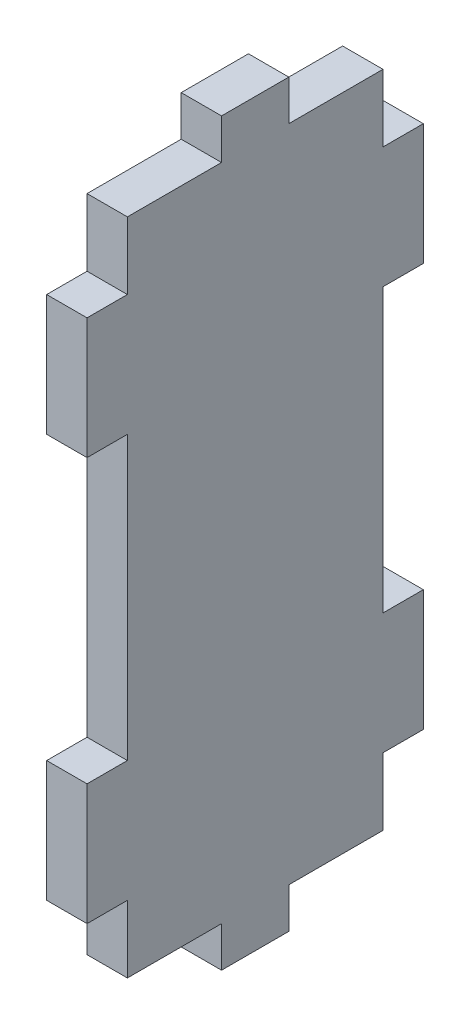
ISO-10303-21;
HEADER;
FILE_DESCRIPTION(('STEP AP214'),'2;1');
FILE_NAME('part.step','',(''),(''),'','','');
FILE_SCHEMA(('AUTOMOTIVE_DESIGN { 1 0 10303 214 1 1 1 1 }'));
ENDSEC;
DATA;
#1=APPLICATION_CONTEXT('core data for automotive mechanical design processes');
#2=APPLICATION_PROTOCOL_DEFINITION('international standard','automotive_design',2000,#1);
#3=PRODUCT_CONTEXT('',#1,'mechanical');
#4=PRODUCT('Part','Part','',(#3));
#5=PRODUCT_RELATED_PRODUCT_CATEGORY('part','',(#4));
#6=PRODUCT_DEFINITION_FORMATION('','',#4);
#7=PRODUCT_DEFINITION_CONTEXT('part definition',#1,'design');
#8=PRODUCT_DEFINITION('design','',#6,#7);
#9=PRODUCT_DEFINITION_SHAPE('','',#8);
#10=(LENGTH_UNIT() NAMED_UNIT(*) SI_UNIT(.MILLI.,.METRE.));
#11=(NAMED_UNIT(*) PLANE_ANGLE_UNIT() SI_UNIT($,.RADIAN.));
#12=(NAMED_UNIT(*) SI_UNIT($,.STERADIAN.) SOLID_ANGLE_UNIT());
#13=UNCERTAINTY_MEASURE_WITH_UNIT(LENGTH_MEASURE(1.E-05),#10,'distance_accuracy_value','');
#14=(GEOMETRIC_REPRESENTATION_CONTEXT(3) GLOBAL_UNCERTAINTY_ASSIGNED_CONTEXT((#13)) GLOBAL_UNIT_ASSIGNED_CONTEXT((#10,
#11,#12)) REPRESENTATION_CONTEXT('',''));
#15=CARTESIAN_POINT('',(0.,0.,0.));
#16=DIRECTION('',(0.,0.,1.));
#17=DIRECTION('',(1.,0.,0.));
#18=AXIS2_PLACEMENT_3D('',#15,#16,#17);
#19=CARTESIAN_POINT('',(3.,0.,0.));
#20=DIRECTION('',(0.,1.,0.));
#21=DIRECTION('',(0.,0.,1.));
#22=AXIS2_PLACEMENT_3D('',#19,#20,#21);
#23=PLANE('',#22);
#24=DIRECTION('',(0.,0.,-1.));
#25=VECTOR('',#24,1.);
#26=CARTESIAN_POINT('',(3.,0.,0.));
#27=LINE('',#26,#25);
#28=CARTESIAN_POINT('',(3.,0.,-10.));
#29=VERTEX_POINT('',#28);
#30=CARTESIAN_POINT('',(3.,0.,-15.));
#31=VERTEX_POINT('',#30);
#32=EDGE_CURVE('E271',#29,#31,#27,.T.);
#33=ORIENTED_EDGE('',*,*,#32,.F.);
#34=DIRECTION('',(1.,0.,0.));
#35=VECTOR('',#34,1.);
#36=CARTESIAN_POINT('',(0.,0.,-10.));
#37=LINE('',#36,#35);
#38=CARTESIAN_POINT('',(0.,0.,-10.));
#39=VERTEX_POINT('',#38);
#40=EDGE_CURVE('E405',#39,#29,#37,.T.);
#41=ORIENTED_EDGE('',*,*,#40,.F.);
#42=DIRECTION('',(0.,0.,-1.));
#43=VECTOR('',#42,1.);
#44=CARTESIAN_POINT('',(0.,0.,0.));
#45=LINE('',#44,#43);
#46=CARTESIAN_POINT('',(0.,0.,-15.));
#47=VERTEX_POINT('',#46);
#48=EDGE_CURVE('E259',#39,#47,#45,.T.);
#49=ORIENTED_EDGE('',*,*,#48,.T.);
#50=DIRECTION('',(1.,0.,0.));
#51=VECTOR('',#50,1.);
#52=CARTESIAN_POINT('',(0.,0.,-15.));
#53=LINE('',#52,#51);
#54=EDGE_CURVE('E420',#47,#31,#53,.T.);
#55=ORIENTED_EDGE('',*,*,#54,.T.);
#56=EDGE_LOOP('',(#33,#41,#49,#55));
#57=FACE_BOUND('',#56,.T.);
#58=ADVANCED_FACE('F35',(#57),#23,.F.);
#59=CARTESIAN_POINT('',(3.,55.,0.));
#60=DIRECTION('',(0.,-1.,0.));
#61=DIRECTION('',(0.,0.,-1.));
#62=AXIS2_PLACEMENT_3D('',#59,#60,#61);
#63=PLANE('',#62);
#64=DIRECTION('',(0.,0.,1.));
#65=VECTOR('',#64,1.);
#66=CARTESIAN_POINT('',(3.,55.,0.));
#67=LINE('',#66,#65);
#68=CARTESIAN_POINT('',(3.,55.,-15.));
#69=VERTEX_POINT('',#68);
#70=CARTESIAN_POINT('',(3.,55.,-10.));
#71=VERTEX_POINT('',#70);
#72=EDGE_CURVE('E12',#69,#71,#67,.T.);
#73=ORIENTED_EDGE('',*,*,#72,.F.);
#74=DIRECTION('',(1.,0.,0.));
#75=VECTOR('',#74,1.);
#76=CARTESIAN_POINT('',(0.,55.,-15.));
#77=LINE('',#76,#75);
#78=CARTESIAN_POINT('',(0.,55.,-15.));
#79=VERTEX_POINT('',#78);
#80=EDGE_CURVE('E227',#79,#69,#77,.T.);
#81=ORIENTED_EDGE('',*,*,#80,.F.);
#82=DIRECTION('',(0.,0.,1.));
#83=VECTOR('',#82,1.);
#84=CARTESIAN_POINT('',(0.,55.,0.));
#85=LINE('',#84,#83);
#86=CARTESIAN_POINT('',(0.,55.,-10.));
#87=VERTEX_POINT('',#86);
#88=EDGE_CURVE('E39',#79,#87,#85,.T.);
#89=ORIENTED_EDGE('',*,*,#88,.T.);
#90=DIRECTION('',(1.,0.,0.));
#91=VECTOR('',#90,1.);
#92=CARTESIAN_POINT('',(0.,55.,-10.));
#93=LINE('',#92,#91);
#94=EDGE_CURVE('E388',#87,#71,#93,.T.);
#95=ORIENTED_EDGE('',*,*,#94,.T.);
#96=EDGE_LOOP('',(#73,#81,#89,#95));
#97=FACE_BOUND('',#96,.T.);
#98=ADVANCED_FACE('F240',(#97),#63,.F.);
#99=CARTESIAN_POINT('',(3.,0.,0.));
#100=DIRECTION('',(-1.,0.,0.));
#101=DIRECTION('',(0.,0.,1.));
#102=AXIS2_PLACEMENT_3D('',#99,#100,#101);
#103=PLANE('',#102);
#104=DIRECTION('',(0.,0.,-1.));
#105=VECTOR('',#104,1.);
#106=CARTESIAN_POINT('',(3.,3.,0.));
#107=LINE('',#106,#105);
#108=CARTESIAN_POINT('',(3.,3.,-3.00000000000001));
#109=VERTEX_POINT('',#108);
#110=CARTESIAN_POINT('',(3.,3.,-10.));
#111=VERTEX_POINT('',#110);
#112=EDGE_CURVE('E415',#109,#111,#107,.T.);
#113=ORIENTED_EDGE('',*,*,#112,.T.);
#114=DIRECTION('',(0.,1.,0.));
#115=VECTOR('',#114,1.);
#116=CARTESIAN_POINT('',(3.,0.,-10.));
#117=LINE('',#116,#115);
#118=EDGE_CURVE('E411',#29,#111,#117,.T.);
#119=ORIENTED_EDGE('',*,*,#118,.F.);
#120=ORIENTED_EDGE('',*,*,#32,.T.);
#121=DIRECTION('',(0.,1.,0.));
#122=VECTOR('',#121,1.);
#123=CARTESIAN_POINT('',(3.,0.,-15.));
#124=LINE('',#123,#122);
#125=CARTESIAN_POINT('',(3.,3.,-15.));
#126=VERTEX_POINT('',#125);
#127=EDGE_CURVE('E410',#31,#126,#124,.T.);
#128=ORIENTED_EDGE('',*,*,#127,.T.);
#129=DIRECTION('',(0.,0.,-1.));
#130=VECTOR('',#129,1.);
#131=CARTESIAN_POINT('',(3.,3.,0.));
#132=LINE('',#131,#130);
#133=CARTESIAN_POINT('',(3.,3.,-22.));
#134=VERTEX_POINT('',#133);
#135=EDGE_CURVE('E429',#126,#134,#132,.T.);
#136=ORIENTED_EDGE('',*,*,#135,.T.);
#137=DIRECTION('',(0.,-1.,0.));
#138=VECTOR('',#137,1.);
#139=CARTESIAN_POINT('',(3.,0.,-22.));
#140=LINE('',#139,#138);
#141=CARTESIAN_POINT('',(3.,8.,-22.));
#142=VERTEX_POINT('',#141);
#143=EDGE_CURVE('E376',#142,#134,#140,.T.);
#144=ORIENTED_EDGE('',*,*,#143,.F.);
#145=DIRECTION('',(0.,0.,1.));
#146=VECTOR('',#145,1.);
#147=CARTESIAN_POINT('',(3.,8.,0.));
#148=LINE('',#147,#146);
#149=CARTESIAN_POINT('',(3.,8.,-25.));
#150=VERTEX_POINT('',#149);
#151=EDGE_CURVE('E380',#150,#142,#148,.T.);
#152=ORIENTED_EDGE('',*,*,#151,.F.);
#153=DIRECTION('',(0.,1.,0.));
#154=VECTOR('',#153,1.);
#155=CARTESIAN_POINT('',(3.,0.,-25.));
#156=LINE('',#155,#154);
#157=CARTESIAN_POINT('',(3.,17.,-25.));
#158=VERTEX_POINT('',#157);
#159=EDGE_CURVE('E44',#150,#158,#156,.T.);
#160=ORIENTED_EDGE('',*,*,#159,.T.);
#161=DIRECTION('',(0.,0.,1.));
#162=VECTOR('',#161,1.);
#163=CARTESIAN_POINT('',(3.,17.,0.));
#164=LINE('',#163,#162);
#165=CARTESIAN_POINT('',(3.,17.,-22.));
#166=VERTEX_POINT('',#165);
#167=EDGE_CURVE('E343',#158,#166,#164,.T.);
#168=ORIENTED_EDGE('',*,*,#167,.T.);
#169=DIRECTION('',(0.,-1.,0.));
#170=VECTOR('',#169,1.);
#171=CARTESIAN_POINT('',(3.,0.,-22.));
#172=LINE('',#171,#170);
#173=CARTESIAN_POINT('',(3.,38.,-22.));
#174=VERTEX_POINT('',#173);
#175=EDGE_CURVE('E347',#174,#166,#172,.T.);
#176=ORIENTED_EDGE('',*,*,#175,.F.);
#177=DIRECTION('',(0.,0.,1.));
#178=VECTOR('',#177,1.);
#179=CARTESIAN_POINT('',(3.,38.,0.));
#180=LINE('',#179,#178);
#181=CARTESIAN_POINT('',(3.,38.,-25.));
#182=VERTEX_POINT('',#181);
#183=EDGE_CURVE('E317',#182,#174,#180,.T.);
#184=ORIENTED_EDGE('',*,*,#183,.F.);
#185=CARTESIAN_POINT('',(3.,47.,-25.));
#186=VERTEX_POINT('',#185);
#187=EDGE_CURVE('E268',#182,#186,#156,.T.);
#188=ORIENTED_EDGE('',*,*,#187,.T.);
#189=DIRECTION('',(0.,0.,1.));
#190=VECTOR('',#189,1.);
#191=CARTESIAN_POINT('',(3.,47.,0.));
#192=LINE('',#191,#190);
#193=CARTESIAN_POINT('',(3.,47.,-22.));
#194=VERTEX_POINT('',#193);
#195=EDGE_CURVE('E364',#186,#194,#192,.T.);
#196=ORIENTED_EDGE('',*,*,#195,.T.);
#197=DIRECTION('',(0.,-1.,0.));
#198=VECTOR('',#197,1.);
#199=CARTESIAN_POINT('',(3.,0.,-22.));
#200=LINE('',#199,#198);
#201=CARTESIAN_POINT('',(3.,52.,-22.));
#202=VERTEX_POINT('',#201);
#203=EDGE_CURVE('E342',#202,#194,#200,.T.);
#204=ORIENTED_EDGE('',*,*,#203,.F.);
#205=DIRECTION('',(0.,0.,-1.));
#206=VECTOR('',#205,1.);
#207=CARTESIAN_POINT('',(3.,52.,0.));
#208=LINE('',#207,#206);
#209=CARTESIAN_POINT('',(3.,52.,-15.));
#210=VERTEX_POINT('',#209);
#211=EDGE_CURVE('E235',#210,#202,#208,.T.);
#212=ORIENTED_EDGE('',*,*,#211,.F.);
#213=DIRECTION('',(0.,-1.,0.));
#214=VECTOR('',#213,1.);
#215=CARTESIAN_POINT('',(3.,0.,-15.));
#216=LINE('',#215,#214);
#217=EDGE_CURVE('E428',#69,#210,#216,.T.);
#218=ORIENTED_EDGE('',*,*,#217,.F.);
#219=ORIENTED_EDGE('',*,*,#72,.T.);
#220=DIRECTION('',(0.,-1.,0.));
#221=VECTOR('',#220,1.);
#222=CARTESIAN_POINT('',(3.,0.,-10.));
#223=LINE('',#222,#221);
#224=CARTESIAN_POINT('',(3.,52.,-10.));
#225=VERTEX_POINT('',#224);
#226=EDGE_CURVE('E396',#71,#225,#223,.T.);
#227=ORIENTED_EDGE('',*,*,#226,.T.);
#228=DIRECTION('',(0.,0.,-1.));
#229=VECTOR('',#228,1.);
#230=CARTESIAN_POINT('',(3.,52.,0.));
#231=LINE('',#230,#229);
#232=CARTESIAN_POINT('',(3.,52.,-3.));
#233=VERTEX_POINT('',#232);
#234=EDGE_CURVE('E393',#233,#225,#231,.T.);
#235=ORIENTED_EDGE('',*,*,#234,.F.);
#236=DIRECTION('',(0.,-1.,0.));
#237=VECTOR('',#236,1.);
#238=CARTESIAN_POINT('',(3.,0.,-3.00000000000001));
#239=LINE('',#238,#237);
#240=CARTESIAN_POINT('',(3.,47.,-3.));
#241=VERTEX_POINT('',#240);
#242=EDGE_CURVE('E279',#233,#241,#239,.T.);
#243=ORIENTED_EDGE('',*,*,#242,.T.);
#244=DIRECTION('',(0.,0.,-1.));
#245=VECTOR('',#244,1.);
#246=CARTESIAN_POINT('',(3.,47.,0.));
#247=LINE('',#246,#245);
#248=CARTESIAN_POINT('',(3.,47.,0.));
#249=VERTEX_POINT('',#248);
#250=EDGE_CURVE('E282',#249,#241,#247,.T.);
#251=ORIENTED_EDGE('',*,*,#250,.F.);
#252=DIRECTION('',(0.,-1.,0.));
#253=VECTOR('',#252,1.);
#254=CARTESIAN_POINT('',(3.,0.,0.));
#255=LINE('',#254,#253);
#256=CARTESIAN_POINT('',(3.,38.,0.));
#257=VERTEX_POINT('',#256);
#258=EDGE_CURVE('E250',#249,#257,#255,.T.);
#259=ORIENTED_EDGE('',*,*,#258,.T.);
#260=DIRECTION('',(0.,0.,-1.));
#261=VECTOR('',#260,1.);
#262=CARTESIAN_POINT('',(3.,38.,0.));
#263=LINE('',#262,#261);
#264=CARTESIAN_POINT('',(3.,38.,-3.));
#265=VERTEX_POINT('',#264);
#266=EDGE_CURVE('E318',#257,#265,#263,.T.);
#267=ORIENTED_EDGE('',*,*,#266,.T.);
#268=DIRECTION('',(0.,-1.,0.));
#269=VECTOR('',#268,1.);
#270=CARTESIAN_POINT('',(3.,0.,-3.00000000000001));
#271=LINE('',#270,#269);
#272=CARTESIAN_POINT('',(3.,17.,-3.));
#273=VERTEX_POINT('',#272);
#274=EDGE_CURVE('E322',#265,#273,#271,.T.);
#275=ORIENTED_EDGE('',*,*,#274,.T.);
#276=DIRECTION('',(0.,0.,-1.));
#277=VECTOR('',#276,1.);
#278=CARTESIAN_POINT('',(3.,17.,0.));
#279=LINE('',#278,#277);
#280=CARTESIAN_POINT('',(3.,17.,0.));
#281=VERTEX_POINT('',#280);
#282=EDGE_CURVE('E295',#281,#273,#279,.T.);
#283=ORIENTED_EDGE('',*,*,#282,.F.);
#284=CARTESIAN_POINT('',(3.,8.,0.));
#285=VERTEX_POINT('',#284);
#286=EDGE_CURVE('E247',#281,#285,#255,.T.);
#287=ORIENTED_EDGE('',*,*,#286,.T.);
#288=DIRECTION('',(0.,0.,-1.));
#289=VECTOR('',#288,1.);
#290=CARTESIAN_POINT('',(3.,8.,0.));
#291=LINE('',#290,#289);
#292=CARTESIAN_POINT('',(3.,8.,-3.00000000000001));
#293=VERTEX_POINT('',#292);
#294=EDGE_CURVE('E296',#285,#293,#291,.T.);
#295=ORIENTED_EDGE('',*,*,#294,.T.);
#296=DIRECTION('',(0.,-1.,0.));
#297=VECTOR('',#296,1.);
#298=CARTESIAN_POINT('',(3.,0.,-3.00000000000001));
#299=LINE('',#298,#297);
#300=EDGE_CURVE('E300',#293,#109,#299,.T.);
#301=ORIENTED_EDGE('',*,*,#300,.T.);
#302=EDGE_LOOP('',(#113,#119,#120,#128,#136,#144,#152,#160,#168,#176,#184,#188,#196,#204,#212,
#218,#219,#227,#235,#243,#251,#259,#267,#275,#283,#287,#295,#301));
#303=FACE_BOUND('',#302,.T.);
#304=ADVANCED_FACE('F462',(#303),#103,.F.);
#305=CARTESIAN_POINT('',(0.,0.,0.));
#306=DIRECTION('',(-1.,0.,0.));
#307=DIRECTION('',(0.,0.,1.));
#308=AXIS2_PLACEMENT_3D('',#305,#306,#307);
#309=PLANE('',#308);
#310=DIRECTION('',(0.,1.,0.));
#311=VECTOR('',#310,1.);
#312=CARTESIAN_POINT('',(0.,0.,-10.));
#313=LINE('',#312,#311);
#314=CARTESIAN_POINT('',(0.,3.,-10.));
#315=VERTEX_POINT('',#314);
#316=EDGE_CURVE('E406',#39,#315,#313,.T.);
#317=ORIENTED_EDGE('',*,*,#316,.T.);
#318=DIRECTION('',(0.,0.,-1.));
#319=VECTOR('',#318,1.);
#320=CARTESIAN_POINT('',(0.,3.,0.));
#321=LINE('',#320,#319);
#322=CARTESIAN_POINT('',(0.,3.,-3.00000000000001));
#323=VERTEX_POINT('',#322);
#324=EDGE_CURVE('E414',#323,#315,#321,.T.);
#325=ORIENTED_EDGE('',*,*,#324,.F.);
#326=DIRECTION('',(0.,-1.,0.));
#327=VECTOR('',#326,1.);
#328=CARTESIAN_POINT('',(0.,0.,-3.00000000000001));
#329=LINE('',#328,#327);
#330=CARTESIAN_POINT('',(0.,8.,-3.00000000000001));
#331=VERTEX_POINT('',#330);
#332=EDGE_CURVE('E299',#331,#323,#329,.T.);
#333=ORIENTED_EDGE('',*,*,#332,.F.);
#334=DIRECTION('',(0.,0.,-1.));
#335=VECTOR('',#334,1.);
#336=CARTESIAN_POINT('',(0.,8.,0.));
#337=LINE('',#336,#335);
#338=CARTESIAN_POINT('',(0.,8.,0.));
#339=VERTEX_POINT('',#338);
#340=EDGE_CURVE('E292',#339,#331,#337,.T.);
#341=ORIENTED_EDGE('',*,*,#340,.F.);
#342=DIRECTION('',(0.,-1.,0.));
#343=VECTOR('',#342,1.);
#344=CARTESIAN_POINT('',(0.,0.,0.));
#345=LINE('',#344,#343);
#346=CARTESIAN_POINT('',(0.,17.,0.));
#347=VERTEX_POINT('',#346);
#348=EDGE_CURVE('E264',#347,#339,#345,.T.);
#349=ORIENTED_EDGE('',*,*,#348,.F.);
#350=DIRECTION('',(0.,0.,-1.));
#351=VECTOR('',#350,1.);
#352=CARTESIAN_POINT('',(0.,17.,0.));
#353=LINE('',#352,#351);
#354=CARTESIAN_POINT('',(0.,17.,-3.));
#355=VERTEX_POINT('',#354);
#356=EDGE_CURVE('E321',#347,#355,#353,.T.);
#357=ORIENTED_EDGE('',*,*,#356,.T.);
#358=DIRECTION('',(0.,-1.,0.));
#359=VECTOR('',#358,1.);
#360=CARTESIAN_POINT('',(0.,0.,-3.00000000000001));
#361=LINE('',#360,#359);
#362=CARTESIAN_POINT('',(0.,38.,-3.));
#363=VERTEX_POINT('',#362);
#364=EDGE_CURVE('E328',#363,#355,#361,.T.);
#365=ORIENTED_EDGE('',*,*,#364,.F.);
#366=DIRECTION('',(0.,0.,-1.));
#367=VECTOR('',#366,1.);
#368=CARTESIAN_POINT('',(0.,38.,0.));
#369=LINE('',#368,#367);
#370=CARTESIAN_POINT('',(0.,38.,0.));
#371=VERTEX_POINT('',#370);
#372=EDGE_CURVE('E310',#371,#363,#369,.T.);
#373=ORIENTED_EDGE('',*,*,#372,.F.);
#374=CARTESIAN_POINT('',(0.,47.,0.));
#375=VERTEX_POINT('',#374);
#376=EDGE_CURVE('E263',#375,#371,#345,.T.);
#377=ORIENTED_EDGE('',*,*,#376,.F.);
#378=DIRECTION('',(0.,0.,-1.));
#379=VECTOR('',#378,1.);
#380=CARTESIAN_POINT('',(0.,47.,0.));
#381=LINE('',#380,#379);
#382=CARTESIAN_POINT('',(0.,47.,-3.));
#383=VERTEX_POINT('',#382);
#384=EDGE_CURVE('E281',#375,#383,#381,.T.);
#385=ORIENTED_EDGE('',*,*,#384,.T.);
#386=DIRECTION('',(0.,-1.,0.));
#387=VECTOR('',#386,1.);
#388=CARTESIAN_POINT('',(0.,0.,-3.00000000000001));
#389=LINE('',#388,#387);
#390=CARTESIAN_POINT('',(0.,52.,-3.));
#391=VERTEX_POINT('',#390);
#392=EDGE_CURVE('E276',#391,#383,#389,.T.);
#393=ORIENTED_EDGE('',*,*,#392,.F.);
#394=DIRECTION('',(0.,0.,-1.));
#395=VECTOR('',#394,1.);
#396=CARTESIAN_POINT('',(0.,52.,0.));
#397=LINE('',#396,#395);
#398=CARTESIAN_POINT('',(0.,52.,-10.));
#399=VERTEX_POINT('',#398);
#400=EDGE_CURVE('E52',#391,#399,#397,.T.);
#401=ORIENTED_EDGE('',*,*,#400,.T.);
#402=DIRECTION('',(0.,-1.,0.));
#403=VECTOR('',#402,1.);
#404=CARTESIAN_POINT('',(0.,0.,-10.));
#405=LINE('',#404,#403);
#406=EDGE_CURVE('E246',#87,#399,#405,.T.);
#407=ORIENTED_EDGE('',*,*,#406,.F.);
#408=ORIENTED_EDGE('',*,*,#88,.F.);
#409=DIRECTION('',(0.,-1.,0.));
#410=VECTOR('',#409,1.);
#411=CARTESIAN_POINT('',(0.,0.,-15.));
#412=LINE('',#411,#410);
#413=CARTESIAN_POINT('',(0.,52.,-15.));
#414=VERTEX_POINT('',#413);
#415=EDGE_CURVE('E223',#79,#414,#412,.T.);
#416=ORIENTED_EDGE('',*,*,#415,.T.);
#417=DIRECTION('',(0.,0.,-1.));
#418=VECTOR('',#417,1.);
#419=CARTESIAN_POINT('',(0.,52.,0.));
#420=LINE('',#419,#418);
#421=CARTESIAN_POINT('',(0.,52.,-22.));
#422=VERTEX_POINT('',#421);
#423=EDGE_CURVE('E234',#414,#422,#420,.T.);
#424=ORIENTED_EDGE('',*,*,#423,.T.);
#425=DIRECTION('',(0.,-1.,0.));
#426=VECTOR('',#425,1.);
#427=CARTESIAN_POINT('',(0.,0.,-22.));
#428=LINE('',#427,#426);
#429=CARTESIAN_POINT('',(0.,47.,-22.));
#430=VERTEX_POINT('',#429);
#431=EDGE_CURVE('E367',#422,#430,#428,.T.);
#432=ORIENTED_EDGE('',*,*,#431,.T.);
#433=DIRECTION('',(0.,0.,1.));
#434=VECTOR('',#433,1.);
#435=CARTESIAN_POINT('',(0.,47.,0.));
#436=LINE('',#435,#434);
#437=CARTESIAN_POINT('',(0.,47.,-25.));
#438=VERTEX_POINT('',#437);
#439=EDGE_CURVE('E361',#438,#430,#436,.T.);
#440=ORIENTED_EDGE('',*,*,#439,.F.);
#441=DIRECTION('',(0.,1.,0.));
#442=VECTOR('',#441,1.);
#443=CARTESIAN_POINT('',(0.,0.,-25.));
#444=LINE('',#443,#442);
#445=CARTESIAN_POINT('',(0.,38.,-25.));
#446=VERTEX_POINT('',#445);
#447=EDGE_CURVE('E253',#446,#438,#444,.T.);
#448=ORIENTED_EDGE('',*,*,#447,.F.);
#449=DIRECTION('',(0.,0.,1.));
#450=VECTOR('',#449,1.);
#451=CARTESIAN_POINT('',(0.,38.,0.));
#452=LINE('',#451,#450);
#453=CARTESIAN_POINT('',(0.,38.,-22.));
#454=VERTEX_POINT('',#453);
#455=EDGE_CURVE('E346',#446,#454,#452,.T.);
#456=ORIENTED_EDGE('',*,*,#455,.T.);
#457=DIRECTION('',(0.,-1.,0.));
#458=VECTOR('',#457,1.);
#459=CARTESIAN_POINT('',(0.,0.,-22.));
#460=LINE('',#459,#458);
#461=CARTESIAN_POINT('',(0.,17.,-22.));
#462=VERTEX_POINT('',#461);
#463=EDGE_CURVE('E353',#454,#462,#460,.T.);
#464=ORIENTED_EDGE('',*,*,#463,.T.);
#465=DIRECTION('',(0.,0.,1.));
#466=VECTOR('',#465,1.);
#467=CARTESIAN_POINT('',(0.,17.,0.));
#468=LINE('',#467,#466);
#469=CARTESIAN_POINT('',(0.,17.,-25.));
#470=VERTEX_POINT('',#469);
#471=EDGE_CURVE('E336',#470,#462,#468,.T.);
#472=ORIENTED_EDGE('',*,*,#471,.F.);
#473=CARTESIAN_POINT('',(0.,8.,-25.));
#474=VERTEX_POINT('',#473);
#475=EDGE_CURVE('E248',#474,#470,#444,.T.);
#476=ORIENTED_EDGE('',*,*,#475,.F.);
#477=DIRECTION('',(0.,0.,1.));
#478=VECTOR('',#477,1.);
#479=CARTESIAN_POINT('',(0.,8.,0.));
#480=LINE('',#479,#478);
#481=CARTESIAN_POINT('',(0.,8.,-22.));
#482=VERTEX_POINT('',#481);
#483=EDGE_CURVE('E379',#474,#482,#480,.T.);
#484=ORIENTED_EDGE('',*,*,#483,.T.);
#485=DIRECTION('',(0.,-1.,0.));
#486=VECTOR('',#485,1.);
#487=CARTESIAN_POINT('',(0.,0.,-22.));
#488=LINE('',#487,#486);
#489=CARTESIAN_POINT('',(0.,3.,-22.));
#490=VERTEX_POINT('',#489);
#491=EDGE_CURVE('E374',#482,#490,#488,.T.);
#492=ORIENTED_EDGE('',*,*,#491,.T.);
#493=DIRECTION('',(0.,0.,-1.));
#494=VECTOR('',#493,1.);
#495=CARTESIAN_POINT('',(0.,3.,0.));
#496=LINE('',#495,#494);
#497=CARTESIAN_POINT('',(0.,3.,-15.));
#498=VERTEX_POINT('',#497);
#499=EDGE_CURVE('E60',#498,#490,#496,.T.);
#500=ORIENTED_EDGE('',*,*,#499,.F.);
#501=DIRECTION('',(0.,1.,0.));
#502=VECTOR('',#501,1.);
#503=CARTESIAN_POINT('',(0.,0.,-15.));
#504=LINE('',#503,#502);
#505=EDGE_CURVE('E432',#47,#498,#504,.T.);
#506=ORIENTED_EDGE('',*,*,#505,.F.);
#507=ORIENTED_EDGE('',*,*,#48,.F.);
#508=EDGE_LOOP('',(#317,#325,#333,#341,#349,#357,#365,#373,#377,#385,#393,#401,#407,#408,#416,
#424,#432,#440,#448,#456,#464,#472,#476,#484,#492,#500,#506,#507));
#509=FACE_BOUND('',#508,.T.);
#510=ADVANCED_FACE('F245',(#509),#309,.T.);
#511=CARTESIAN_POINT('',(0.,0.,-22.));
#512=DIRECTION('',(0.,0.,1.));
#513=DIRECTION('',(1.,0.,0.));
#514=AXIS2_PLACEMENT_3D('',#511,#512,#513);
#515=PLANE('',#514);
#516=DIRECTION('',(1.,0.,0.));
#517=VECTOR('',#516,1.);
#518=CARTESIAN_POINT('',(0.,3.,-22.));
#519=LINE('',#518,#517);
#520=EDGE_CURVE('E423',#490,#134,#519,.T.);
#521=ORIENTED_EDGE('',*,*,#520,.F.);
#522=ORIENTED_EDGE('',*,*,#491,.F.);
#523=DIRECTION('',(1.,0.,0.));
#524=VECTOR('',#523,1.);
#525=CARTESIAN_POINT('',(0.,8.,-22.));
#526=LINE('',#525,#524);
#527=EDGE_CURVE('E303',#482,#142,#526,.T.);
#528=ORIENTED_EDGE('',*,*,#527,.T.);
#529=ORIENTED_EDGE('',*,*,#143,.T.);
#530=EDGE_LOOP('',(#521,#522,#528,#529));
#531=FACE_BOUND('',#530,.T.);
#532=ADVANCED_FACE('F479',(#531),#515,.F.);
#533=CARTESIAN_POINT('',(0.,0.,-3.00000000000001));
#534=DIRECTION('',(0.,0.,1.));
#535=DIRECTION('',(0.,-1.,0.));
#536=AXIS2_PLACEMENT_3D('',#533,#534,#535);
#537=PLANE('',#536);
#538=ORIENTED_EDGE('',*,*,#332,.T.);
#539=DIRECTION('',(1.,0.,0.));
#540=VECTOR('',#539,1.);
#541=CARTESIAN_POINT('',(0.,3.,-3.00000000000001));
#542=LINE('',#541,#540);
#543=EDGE_CURVE('E402',#323,#109,#542,.T.);
#544=ORIENTED_EDGE('',*,*,#543,.T.);
#545=ORIENTED_EDGE('',*,*,#300,.F.);
#546=DIRECTION('',(1.,0.,0.));
#547=VECTOR('',#546,1.);
#548=CARTESIAN_POINT('',(0.,8.,-3.00000000000001));
#549=LINE('',#548,#547);
#550=EDGE_CURVE('E289',#331,#293,#549,.T.);
#551=ORIENTED_EDGE('',*,*,#550,.F.);
#552=EDGE_LOOP('',(#538,#544,#545,#551));
#553=FACE_BOUND('',#552,.T.);
#554=ADVANCED_FACE('F497',(#553),#537,.T.);
#555=CARTESIAN_POINT('',(3.,0.,0.));
#556=DIRECTION('',(0.,0.,-1.));
#557=DIRECTION('',(-1.,0.,0.));
#558=AXIS2_PLACEMENT_3D('',#555,#556,#557);
#559=PLANE('',#558);
#560=DIRECTION('',(1.,0.,0.));
#561=VECTOR('',#560,1.);
#562=CARTESIAN_POINT('',(0.,38.,0.));
#563=LINE('',#562,#561);
#564=EDGE_CURVE('E314',#371,#257,#563,.T.);
#565=ORIENTED_EDGE('',*,*,#564,.T.);
#566=ORIENTED_EDGE('',*,*,#258,.F.);
#567=DIRECTION('',(1.,0.,0.));
#568=VECTOR('',#567,1.);
#569=CARTESIAN_POINT('',(0.,47.,0.));
#570=LINE('',#569,#568);
#571=EDGE_CURVE('E274',#375,#249,#570,.T.);
#572=ORIENTED_EDGE('',*,*,#571,.F.);
#573=ORIENTED_EDGE('',*,*,#376,.T.);
#574=EDGE_LOOP('',(#565,#566,#572,#573));
#575=FACE_BOUND('',#574,.T.);
#576=ADVANCED_FACE('F37',(#575),#559,.F.);
#577=ORIENTED_EDGE('',*,*,#286,.F.);
#578=DIRECTION('',(1.,0.,0.));
#579=VECTOR('',#578,1.);
#580=CARTESIAN_POINT('',(0.,17.,0.));
#581=LINE('',#580,#579);
#582=EDGE_CURVE('E307',#347,#281,#581,.T.);
#583=ORIENTED_EDGE('',*,*,#582,.F.);
#584=ORIENTED_EDGE('',*,*,#348,.T.);
#585=DIRECTION('',(1.,0.,0.));
#586=VECTOR('',#585,1.);
#587=CARTESIAN_POINT('',(0.,8.,0.));
#588=LINE('',#587,#586);
#589=EDGE_CURVE('E291',#339,#285,#588,.T.);
#590=ORIENTED_EDGE('',*,*,#589,.T.);
#591=EDGE_LOOP('',(#577,#583,#584,#590));
#592=FACE_BOUND('',#591,.T.);
#593=ADVANCED_FACE('F505',(#592),#559,.F.);
#594=CARTESIAN_POINT('',(3.,0.,-25.));
#595=DIRECTION('',(0.,0.,1.));
#596=DIRECTION('',(1.,0.,0.));
#597=AXIS2_PLACEMENT_3D('',#594,#595,#596);
#598=PLANE('',#597);
#599=DIRECTION('',(1.,0.,0.));
#600=VECTOR('',#599,1.);
#601=CARTESIAN_POINT('',(0.,47.,-25.));
#602=LINE('',#601,#600);
#603=EDGE_CURVE('E285',#438,#186,#602,.T.);
#604=ORIENTED_EDGE('',*,*,#603,.T.);
#605=ORIENTED_EDGE('',*,*,#187,.F.);
#606=DIRECTION('',(1.,0.,0.));
#607=VECTOR('',#606,1.);
#608=CARTESIAN_POINT('',(0.,38.,-25.));
#609=LINE('',#608,#607);
#610=EDGE_CURVE('E333',#446,#182,#609,.T.);
#611=ORIENTED_EDGE('',*,*,#610,.F.);
#612=ORIENTED_EDGE('',*,*,#447,.T.);
#613=EDGE_LOOP('',(#604,#605,#611,#612));
#614=FACE_BOUND('',#613,.T.);
#615=ADVANCED_FACE('F454',(#614),#598,.F.);
#616=DIRECTION('',(1.,0.,0.));
#617=VECTOR('',#616,1.);
#618=CARTESIAN_POINT('',(0.,17.,-25.));
#619=LINE('',#618,#617);
#620=EDGE_CURVE('E340',#470,#158,#619,.T.);
#621=ORIENTED_EDGE('',*,*,#620,.T.);
#622=ORIENTED_EDGE('',*,*,#159,.F.);
#623=DIRECTION('',(1.,0.,0.));
#624=VECTOR('',#623,1.);
#625=CARTESIAN_POINT('',(0.,8.,-25.));
#626=LINE('',#625,#624);
#627=EDGE_CURVE('E372',#474,#150,#626,.T.);
#628=ORIENTED_EDGE('',*,*,#627,.F.);
#629=ORIENTED_EDGE('',*,*,#475,.T.);
#630=EDGE_LOOP('',(#621,#622,#628,#629));
#631=FACE_BOUND('',#630,.T.);
#632=ADVANCED_FACE('F471',(#631),#598,.F.);
#633=CARTESIAN_POINT('',(0.,0.,-3.00000000000001));
#634=DIRECTION('',(0.,0.,1.));
#635=DIRECTION('',(0.,-1.,0.));
#636=AXIS2_PLACEMENT_3D('',#633,#634,#635);
#637=PLANE('',#636);
#638=DIRECTION('',(1.,0.,0.));
#639=VECTOR('',#638,1.);
#640=CARTESIAN_POINT('',(0.,52.,-3.));
#641=LINE('',#640,#639);
#642=EDGE_CURVE('E390',#391,#233,#641,.T.);
#643=ORIENTED_EDGE('',*,*,#642,.F.);
#644=ORIENTED_EDGE('',*,*,#392,.T.);
#645=DIRECTION('',(1.,0.,0.));
#646=VECTOR('',#645,1.);
#647=CARTESIAN_POINT('',(0.,47.,-3.));
#648=LINE('',#647,#646);
#649=EDGE_CURVE('E266',#383,#241,#648,.T.);
#650=ORIENTED_EDGE('',*,*,#649,.T.);
#651=ORIENTED_EDGE('',*,*,#242,.F.);
#652=EDGE_LOOP('',(#643,#644,#650,#651));
#653=FACE_BOUND('',#652,.T.);
#654=ADVANCED_FACE('F531',(#653),#637,.T.);
#655=CARTESIAN_POINT('',(0.,47.,0.));
#656=DIRECTION('',(0.,-1.,0.));
#657=DIRECTION('',(0.,0.,-1.));
#658=AXIS2_PLACEMENT_3D('',#655,#656,#657);
#659=PLANE('',#658);
#660=ORIENTED_EDGE('',*,*,#250,.T.);
#661=ORIENTED_EDGE('',*,*,#649,.F.);
#662=ORIENTED_EDGE('',*,*,#384,.F.);
#663=ORIENTED_EDGE('',*,*,#571,.T.);
#664=EDGE_LOOP('',(#660,#661,#662,#663));
#665=FACE_BOUND('',#664,.T.);
#666=ADVANCED_FACE('F526',(#665),#659,.F.);
#667=CARTESIAN_POINT('',(0.,8.,0.));
#668=DIRECTION('',(0.,1.,0.));
#669=DIRECTION('',(0.,0.,1.));
#670=AXIS2_PLACEMENT_3D('',#667,#668,#669);
#671=PLANE('',#670);
#672=ORIENTED_EDGE('',*,*,#151,.T.);
#673=ORIENTED_EDGE('',*,*,#527,.F.);
#674=ORIENTED_EDGE('',*,*,#483,.F.);
#675=ORIENTED_EDGE('',*,*,#627,.T.);
#676=EDGE_LOOP('',(#672,#673,#674,#675));
#677=FACE_BOUND('',#676,.T.);
#678=ADVANCED_FACE('F476',(#677),#671,.F.);
#679=CARTESIAN_POINT('',(0.,8.,0.));
#680=DIRECTION('',(0.,-1.,0.));
#681=DIRECTION('',(0.,0.,-1.));
#682=AXIS2_PLACEMENT_3D('',#679,#680,#681);
#683=PLANE('',#682);
#684=ORIENTED_EDGE('',*,*,#294,.F.);
#685=ORIENTED_EDGE('',*,*,#589,.F.);
#686=ORIENTED_EDGE('',*,*,#340,.T.);
#687=ORIENTED_EDGE('',*,*,#550,.T.);
#688=EDGE_LOOP('',(#684,#685,#686,#687));
#689=FACE_BOUND('',#688,.T.);
#690=ADVANCED_FACE('F502',(#689),#683,.T.);
#691=CARTESIAN_POINT('',(0.,38.,0.));
#692=DIRECTION('',(0.,-1.,0.));
#693=DIRECTION('',(0.,0.,-1.));
#694=AXIS2_PLACEMENT_3D('',#691,#692,#693);
#695=PLANE('',#694);
#696=ORIENTED_EDGE('',*,*,#266,.F.);
#697=ORIENTED_EDGE('',*,*,#564,.F.);
#698=ORIENTED_EDGE('',*,*,#372,.T.);
#699=DIRECTION('',(1.,0.,0.));
#700=VECTOR('',#699,1.);
#701=CARTESIAN_POINT('',(0.,38.,-3.));
#702=LINE('',#701,#700);
#703=EDGE_CURVE('E312',#363,#265,#702,.T.);
#704=ORIENTED_EDGE('',*,*,#703,.T.);
#705=EDGE_LOOP('',(#696,#697,#698,#704));
#706=FACE_BOUND('',#705,.T.);
#707=ADVANCED_FACE('F517',(#706),#695,.T.);
#708=CARTESIAN_POINT('',(0.,0.,-3.00000000000001));
#709=DIRECTION('',(0.,0.,1.));
#710=DIRECTION('',(0.,-1.,0.));
#711=AXIS2_PLACEMENT_3D('',#708,#709,#710);
#712=PLANE('',#711);
#713=ORIENTED_EDGE('',*,*,#274,.F.);
#714=ORIENTED_EDGE('',*,*,#703,.F.);
#715=ORIENTED_EDGE('',*,*,#364,.T.);
#716=DIRECTION('',(1.,0.,0.));
#717=VECTOR('',#716,1.);
#718=CARTESIAN_POINT('',(0.,17.,-3.));
#719=LINE('',#718,#717);
#720=EDGE_CURVE('E309',#355,#273,#719,.T.);
#721=ORIENTED_EDGE('',*,*,#720,.T.);
#722=EDGE_LOOP('',(#713,#714,#715,#721));
#723=FACE_BOUND('',#722,.T.);
#724=ADVANCED_FACE('F515',(#723),#712,.T.);
#725=CARTESIAN_POINT('',(0.,17.,0.));
#726=DIRECTION('',(0.,-1.,0.));
#727=DIRECTION('',(0.,0.,-1.));
#728=AXIS2_PLACEMENT_3D('',#725,#726,#727);
#729=PLANE('',#728);
#730=ORIENTED_EDGE('',*,*,#282,.T.);
#731=ORIENTED_EDGE('',*,*,#720,.F.);
#732=ORIENTED_EDGE('',*,*,#356,.F.);
#733=ORIENTED_EDGE('',*,*,#582,.T.);
#734=EDGE_LOOP('',(#730,#731,#732,#733));
#735=FACE_BOUND('',#734,.T.);
#736=ADVANCED_FACE('F511',(#735),#729,.F.);
#737=CARTESIAN_POINT('',(0.,17.,0.));
#738=DIRECTION('',(0.,1.,0.));
#739=DIRECTION('',(0.,0.,1.));
#740=AXIS2_PLACEMENT_3D('',#737,#738,#739);
#741=PLANE('',#740);
#742=ORIENTED_EDGE('',*,*,#167,.F.);
#743=ORIENTED_EDGE('',*,*,#620,.F.);
#744=ORIENTED_EDGE('',*,*,#471,.T.);
#745=DIRECTION('',(1.,0.,0.));
#746=VECTOR('',#745,1.);
#747=CARTESIAN_POINT('',(0.,17.,-22.));
#748=LINE('',#747,#746);
#749=EDGE_CURVE('E338',#462,#166,#748,.T.);
#750=ORIENTED_EDGE('',*,*,#749,.T.);
#751=EDGE_LOOP('',(#742,#743,#744,#750));
#752=FACE_BOUND('',#751,.T.);
#753=ADVANCED_FACE('F469',(#752),#741,.T.);
#754=CARTESIAN_POINT('',(0.,0.,-22.));
#755=DIRECTION('',(0.,0.,1.));
#756=DIRECTION('',(1.,0.,0.));
#757=AXIS2_PLACEMENT_3D('',#754,#755,#756);
#758=PLANE('',#757);
#759=ORIENTED_EDGE('',*,*,#175,.T.);
#760=ORIENTED_EDGE('',*,*,#749,.F.);
#761=ORIENTED_EDGE('',*,*,#463,.F.);
#762=DIRECTION('',(1.,0.,0.));
#763=VECTOR('',#762,1.);
#764=CARTESIAN_POINT('',(0.,38.,-22.));
#765=LINE('',#764,#763);
#766=EDGE_CURVE('E335',#454,#174,#765,.T.);
#767=ORIENTED_EDGE('',*,*,#766,.T.);
#768=EDGE_LOOP('',(#759,#760,#761,#767));
#769=FACE_BOUND('',#768,.T.);
#770=ADVANCED_FACE('F466',(#769),#758,.F.);
#771=CARTESIAN_POINT('',(0.,38.,0.));
#772=DIRECTION('',(0.,1.,0.));
#773=DIRECTION('',(0.,0.,1.));
#774=AXIS2_PLACEMENT_3D('',#771,#772,#773);
#775=PLANE('',#774);
#776=ORIENTED_EDGE('',*,*,#183,.T.);
#777=ORIENTED_EDGE('',*,*,#766,.F.);
#778=ORIENTED_EDGE('',*,*,#455,.F.);
#779=ORIENTED_EDGE('',*,*,#610,.T.);
#780=EDGE_LOOP('',(#776,#777,#778,#779));
#781=FACE_BOUND('',#780,.T.);
#782=ADVANCED_FACE('F458',(#781),#775,.F.);
#783=CARTESIAN_POINT('',(0.,47.,0.));
#784=DIRECTION('',(0.,1.,0.));
#785=DIRECTION('',(0.,0.,1.));
#786=AXIS2_PLACEMENT_3D('',#783,#784,#785);
#787=PLANE('',#786);
#788=ORIENTED_EDGE('',*,*,#195,.F.);
#789=ORIENTED_EDGE('',*,*,#603,.F.);
#790=ORIENTED_EDGE('',*,*,#439,.T.);
#791=DIRECTION('',(1.,0.,0.));
#792=VECTOR('',#791,1.);
#793=CARTESIAN_POINT('',(0.,47.,-22.));
#794=LINE('',#793,#792);
#795=EDGE_CURVE('E358',#430,#194,#794,.T.);
#796=ORIENTED_EDGE('',*,*,#795,.T.);
#797=EDGE_LOOP('',(#788,#789,#790,#796));
#798=FACE_BOUND('',#797,.T.);
#799=ADVANCED_FACE('F450',(#798),#787,.T.);
#800=CARTESIAN_POINT('',(0.,0.,-22.));
#801=DIRECTION('',(0.,0.,1.));
#802=DIRECTION('',(1.,0.,0.));
#803=AXIS2_PLACEMENT_3D('',#800,#801,#802);
#804=PLANE('',#803);
#805=ORIENTED_EDGE('',*,*,#431,.F.);
#806=DIRECTION('',(1.,0.,0.));
#807=VECTOR('',#806,1.);
#808=CARTESIAN_POINT('',(0.,52.,-22.));
#809=LINE('',#808,#807);
#810=EDGE_CURVE('E399',#422,#202,#809,.T.);
#811=ORIENTED_EDGE('',*,*,#810,.T.);
#812=ORIENTED_EDGE('',*,*,#203,.T.);
#813=ORIENTED_EDGE('',*,*,#795,.F.);
#814=EDGE_LOOP('',(#805,#811,#812,#813));
#815=FACE_BOUND('',#814,.T.);
#816=ADVANCED_FACE('F447',(#815),#804,.F.);
#817=CARTESIAN_POINT('',(0.,52.,0.));
#818=DIRECTION('',(0.,-1.,0.));
#819=DIRECTION('',(0.,0.,-1.));
#820=AXIS2_PLACEMENT_3D('',#817,#818,#819);
#821=PLANE('',#820);
#822=ORIENTED_EDGE('',*,*,#211,.T.);
#823=ORIENTED_EDGE('',*,*,#810,.F.);
#824=ORIENTED_EDGE('',*,*,#423,.F.);
#825=DIRECTION('',(1.,0.,0.));
#826=VECTOR('',#825,1.);
#827=CARTESIAN_POINT('',(0.,52.,-15.));
#828=LINE('',#827,#826);
#829=EDGE_CURVE('E229',#414,#210,#828,.T.);
#830=ORIENTED_EDGE('',*,*,#829,.T.);
#831=EDGE_LOOP('',(#822,#823,#824,#830));
#832=FACE_BOUND('',#831,.T.);
#833=ADVANCED_FACE('F579',(#832),#821,.F.);
#834=CARTESIAN_POINT('',(0.,0.,-15.));
#835=DIRECTION('',(0.,0.,1.));
#836=DIRECTION('',(1.,0.,0.));
#837=AXIS2_PLACEMENT_3D('',#834,#835,#836);
#838=PLANE('',#837);
#839=ORIENTED_EDGE('',*,*,#217,.T.);
#840=ORIENTED_EDGE('',*,*,#829,.F.);
#841=ORIENTED_EDGE('',*,*,#415,.F.);
#842=ORIENTED_EDGE('',*,*,#80,.T.);
#843=EDGE_LOOP('',(#839,#840,#841,#842));
#844=FACE_BOUND('',#843,.T.);
#845=ADVANCED_FACE('F226',(#844),#838,.F.);
#846=CARTESIAN_POINT('',(0.,3.,0.));
#847=DIRECTION('',(0.,-1.,0.));
#848=DIRECTION('',(0.,0.,-1.));
#849=AXIS2_PLACEMENT_3D('',#846,#847,#848);
#850=PLANE('',#849);
#851=ORIENTED_EDGE('',*,*,#112,.F.);
#852=ORIENTED_EDGE('',*,*,#543,.F.);
#853=ORIENTED_EDGE('',*,*,#324,.T.);
#854=DIRECTION('',(1.,0.,0.));
#855=VECTOR('',#854,1.);
#856=CARTESIAN_POINT('',(0.,3.,-10.));
#857=LINE('',#856,#855);
#858=EDGE_CURVE('E408',#315,#111,#857,.T.);
#859=ORIENTED_EDGE('',*,*,#858,.T.);
#860=EDGE_LOOP('',(#851,#852,#853,#859));
#861=FACE_BOUND('',#860,.T.);
#862=ADVANCED_FACE('F494',(#861),#850,.T.);
#863=CARTESIAN_POINT('',(0.,0.,-10.));
#864=DIRECTION('',(0.,0.,-1.));
#865=DIRECTION('',(-1.,0.,0.));
#866=AXIS2_PLACEMENT_3D('',#863,#864,#865);
#867=PLANE('',#866);
#868=ORIENTED_EDGE('',*,*,#118,.T.);
#869=ORIENTED_EDGE('',*,*,#858,.F.);
#870=ORIENTED_EDGE('',*,*,#316,.F.);
#871=ORIENTED_EDGE('',*,*,#40,.T.);
#872=EDGE_LOOP('',(#868,#869,#870,#871));
#873=FACE_BOUND('',#872,.T.);
#874=ADVANCED_FACE('F492',(#873),#867,.F.);
#875=CARTESIAN_POINT('',(0.,0.,-15.));
#876=DIRECTION('',(0.,0.,-1.));
#877=DIRECTION('',(-1.,0.,0.));
#878=AXIS2_PLACEMENT_3D('',#875,#876,#877);
#879=PLANE('',#878);
#880=ORIENTED_EDGE('',*,*,#127,.F.);
#881=ORIENTED_EDGE('',*,*,#54,.F.);
#882=ORIENTED_EDGE('',*,*,#505,.T.);
#883=DIRECTION('',(1.,0.,0.));
#884=VECTOR('',#883,1.);
#885=CARTESIAN_POINT('',(0.,3.,-15.));
#886=LINE('',#885,#884);
#887=EDGE_CURVE('E425',#498,#126,#886,.T.);
#888=ORIENTED_EDGE('',*,*,#887,.T.);
#889=EDGE_LOOP('',(#880,#881,#882,#888));
#890=FACE_BOUND('',#889,.T.);
#891=ADVANCED_FACE('F484',(#890),#879,.T.);
#892=CARTESIAN_POINT('',(0.,3.,0.));
#893=DIRECTION('',(0.,-1.,0.));
#894=DIRECTION('',(0.,0.,-1.));
#895=AXIS2_PLACEMENT_3D('',#892,#893,#894);
#896=PLANE('',#895);
#897=ORIENTED_EDGE('',*,*,#135,.F.);
#898=ORIENTED_EDGE('',*,*,#887,.F.);
#899=ORIENTED_EDGE('',*,*,#499,.T.);
#900=ORIENTED_EDGE('',*,*,#520,.T.);
#901=EDGE_LOOP('',(#897,#898,#899,#900));
#902=FACE_BOUND('',#901,.T.);
#903=ADVANCED_FACE('F480',(#902),#896,.T.);
#904=CARTESIAN_POINT('',(0.,0.,-10.));
#905=DIRECTION('',(0.,0.,1.));
#906=DIRECTION('',(1.,0.,0.));
#907=AXIS2_PLACEMENT_3D('',#904,#905,#906);
#908=PLANE('',#907);
#909=ORIENTED_EDGE('',*,*,#226,.F.);
#910=ORIENTED_EDGE('',*,*,#94,.F.);
#911=ORIENTED_EDGE('',*,*,#406,.T.);
#912=DIRECTION('',(1.,0.,0.));
#913=VECTOR('',#912,1.);
#914=CARTESIAN_POINT('',(0.,52.,-10.));
#915=LINE('',#914,#913);
#916=EDGE_CURVE('E383',#399,#225,#915,.T.);
#917=ORIENTED_EDGE('',*,*,#916,.T.);
#918=EDGE_LOOP('',(#909,#910,#911,#917));
#919=FACE_BOUND('',#918,.T.);
#920=ADVANCED_FACE('F535',(#919),#908,.T.);
#921=CARTESIAN_POINT('',(0.,52.,0.));
#922=DIRECTION('',(0.,-1.,0.));
#923=DIRECTION('',(0.,0.,-1.));
#924=AXIS2_PLACEMENT_3D('',#921,#922,#923);
#925=PLANE('',#924);
#926=ORIENTED_EDGE('',*,*,#234,.T.);
#927=ORIENTED_EDGE('',*,*,#916,.F.);
#928=ORIENTED_EDGE('',*,*,#400,.F.);
#929=ORIENTED_EDGE('',*,*,#642,.T.);
#930=EDGE_LOOP('',(#926,#927,#928,#929));
#931=FACE_BOUND('',#930,.T.);
#932=ADVANCED_FACE('F533',(#931),#925,.F.);
#933=CLOSED_SHELL('',(#58,#98,#304,#510,#532,#554,#576,#593,#615,#632,#654,#666,#678,#690,#707,
#724,#736,#753,#770,#782,#799,#816,#833,#845,#862,#874,#891,#903,#920,#932));
#934=MANIFOLD_SOLID_BREP('B2',#933);
#935=ADVANCED_BREP_SHAPE_REPRESENTATION('',(#18,#934),#14);
#936=SHAPE_DEFINITION_REPRESENTATION(#9,#935);
ENDSEC;
END-ISO-10303-21;
